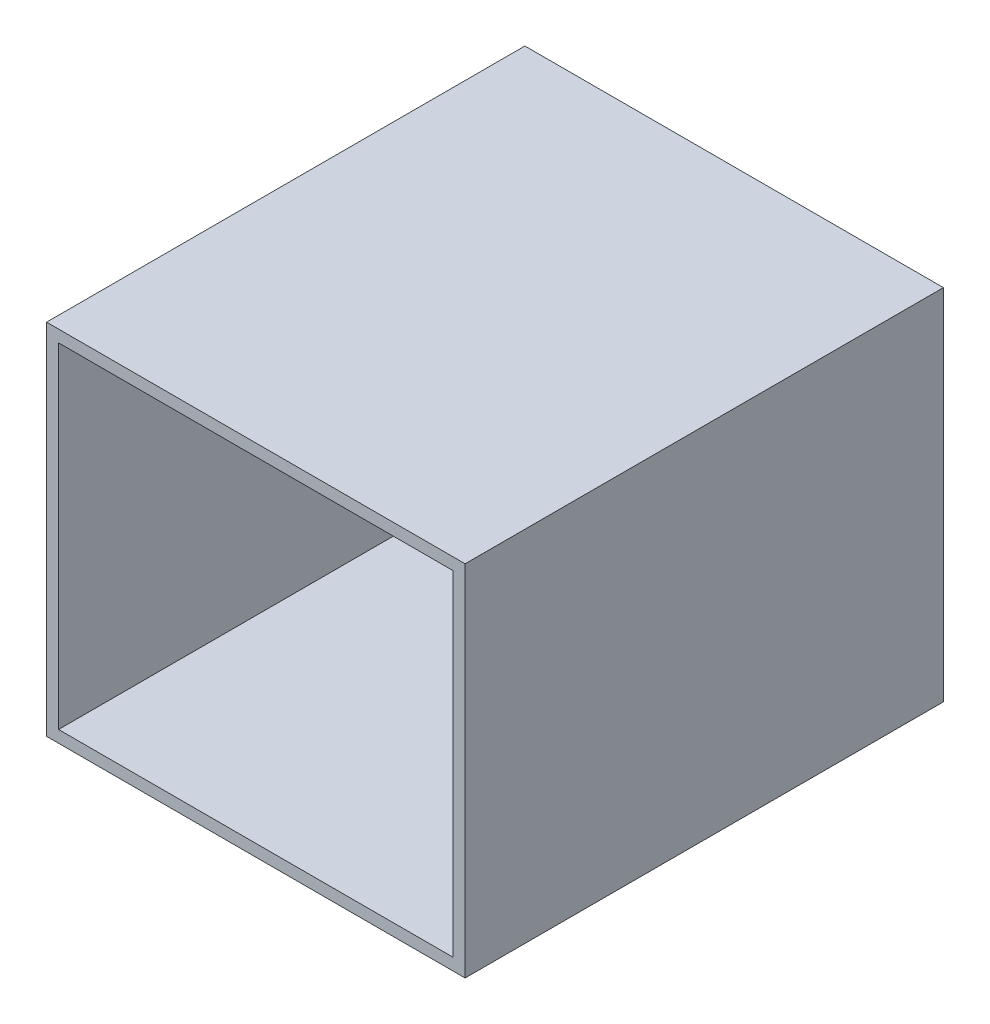
ISO-10303-21;
HEADER;
FILE_DESCRIPTION(('STEP AP214'),'2;1');
FILE_NAME('part.step','',(''),(''),'','','');
FILE_SCHEMA(('AUTOMOTIVE_DESIGN { 1 0 10303 214 1 1 1 1 }'));
ENDSEC;
DATA;
#1=APPLICATION_CONTEXT('core data for automotive mechanical design processes');
#2=APPLICATION_PROTOCOL_DEFINITION('international standard','automotive_design',2000,#1);
#3=PRODUCT_CONTEXT('',#1,'mechanical');
#4=PRODUCT('Part','Part','',(#3));
#5=PRODUCT_RELATED_PRODUCT_CATEGORY('part','',(#4));
#6=PRODUCT_DEFINITION_FORMATION('','',#4);
#7=PRODUCT_DEFINITION_CONTEXT('part definition',#1,'design');
#8=PRODUCT_DEFINITION('design','',#6,#7);
#9=PRODUCT_DEFINITION_SHAPE('','',#8);
#10=(LENGTH_UNIT() NAMED_UNIT(*) SI_UNIT(.MILLI.,.METRE.));
#11=(NAMED_UNIT(*) PLANE_ANGLE_UNIT() SI_UNIT($,.RADIAN.));
#12=(NAMED_UNIT(*) SI_UNIT($,.STERADIAN.) SOLID_ANGLE_UNIT());
#13=UNCERTAINTY_MEASURE_WITH_UNIT(LENGTH_MEASURE(1.E-05),#10,'distance_accuracy_value','');
#14=(GEOMETRIC_REPRESENTATION_CONTEXT(3) GLOBAL_UNCERTAINTY_ASSIGNED_CONTEXT((#13)) GLOBAL_UNIT_ASSIGNED_CONTEXT((#10,
#11,#12)) REPRESENTATION_CONTEXT('',''));
#15=CARTESIAN_POINT('',(0.,0.,0.));
#16=DIRECTION('',(0.,0.,1.));
#17=DIRECTION('',(1.,0.,0.));
#18=AXIS2_PLACEMENT_3D('',#15,#16,#17);
#19=CARTESIAN_POINT('',(0.,0.,10.));
#20=DIRECTION('',(0.,0.,1.));
#21=DIRECTION('',(1.,0.,0.));
#22=AXIS2_PLACEMENT_3D('',#19,#20,#21);
#23=PLANE('',#22);
#24=CARTESIAN_POINT('',(0.,-2.86403489739753,10.));
#25=DIRECTION('',(0.,0.,1.));
#26=DIRECTION('',(1.,0.,0.));
#27=AXIS2_PLACEMENT_3D('',#24,#25,#26);
#28=CIRCLE('',#27,60.);
#29=CARTESIAN_POINT('',(60.,-2.86403489739753,10.));
#30=VERTEX_POINT('',#29);
#31=EDGE_CURVE('E132',#30,#30,#28,.T.);
#32=ORIENTED_EDGE('',*,*,#31,.F.);
#33=EDGE_LOOP('',(#32));
#34=FACE_BOUND('',#33,.T.);
#35=DIRECTION('',(0.,1.,0.));
#36=VECTOR('',#35,1.);
#37=CARTESIAN_POINT('',(165.,0.,10.));
#38=LINE('',#37,#36);
#39=CARTESIAN_POINT('',(165.,-140.,10.));
#40=VERTEX_POINT('',#39);
#41=CARTESIAN_POINT('',(165.,140.,10.));
#42=VERTEX_POINT('',#41);
#43=EDGE_CURVE('E151',#40,#42,#38,.T.);
#44=ORIENTED_EDGE('',*,*,#43,.T.);
#45=DIRECTION('',(-1.,0.,0.));
#46=VECTOR('',#45,1.);
#47=CARTESIAN_POINT('',(0.,140.,10.));
#48=LINE('',#47,#46);
#49=CARTESIAN_POINT('',(-165.,140.,10.));
#50=VERTEX_POINT('',#49);
#51=EDGE_CURVE('E48',#42,#50,#48,.T.);
#52=ORIENTED_EDGE('',*,*,#51,.T.);
#53=DIRECTION('',(0.,-1.,0.));
#54=VECTOR('',#53,1.);
#55=CARTESIAN_POINT('',(-165.,0.,10.));
#56=LINE('',#55,#54);
#57=CARTESIAN_POINT('',(-165.,-140.,10.));
#58=VERTEX_POINT('',#57);
#59=EDGE_CURVE('E121',#50,#58,#56,.T.);
#60=ORIENTED_EDGE('',*,*,#59,.T.);
#61=DIRECTION('',(1.,0.,0.));
#62=VECTOR('',#61,1.);
#63=CARTESIAN_POINT('',(0.,-140.,10.));
#64=LINE('',#63,#62);
#65=EDGE_CURVE('E158',#58,#40,#64,.T.);
#66=ORIENTED_EDGE('',*,*,#65,.T.);
#67=EDGE_LOOP('',(#44,#52,#60,#66));
#68=FACE_BOUND('',#67,.T.);
#69=ADVANCED_FACE('F33',(#34,#68),#23,.T.);
#70=CARTESIAN_POINT('',(-165.,0.,0.));
#71=DIRECTION('',(-1.,0.,0.));
#72=DIRECTION('',(0.,0.,1.));
#73=AXIS2_PLACEMENT_3D('',#70,#71,#72);
#74=PLANE('',#73);
#75=DIRECTION('',(0.,0.,-1.));
#76=VECTOR('',#75,1.);
#77=CARTESIAN_POINT('',(-165.,140.,0.));
#78=LINE('',#77,#76);
#79=CARTESIAN_POINT('',(-165.,140.,400.));
#80=VERTEX_POINT('',#79);
#81=EDGE_CURVE('E163',#80,#50,#78,.T.);
#82=ORIENTED_EDGE('',*,*,#81,.F.);
#83=DIRECTION('',(0.,1.,0.));
#84=VECTOR('',#83,1.);
#85=CARTESIAN_POINT('',(-165.,150.,400.));
#86=LINE('',#85,#84);
#87=CARTESIAN_POINT('',(-165.,-140.,400.));
#88=VERTEX_POINT('',#87);
#89=EDGE_CURVE('E147',#88,#80,#86,.T.);
#90=ORIENTED_EDGE('',*,*,#89,.F.);
#91=DIRECTION('',(0.,0.,1.));
#92=VECTOR('',#91,1.);
#93=CARTESIAN_POINT('',(-165.,-140.,0.));
#94=LINE('',#93,#92);
#95=EDGE_CURVE('E112',#58,#88,#94,.T.);
#96=ORIENTED_EDGE('',*,*,#95,.F.);
#97=ORIENTED_EDGE('',*,*,#59,.F.);
#98=EDGE_LOOP('',(#82,#90,#96,#97));
#99=FACE_BOUND('',#98,.T.);
#100=ADVANCED_FACE('F177',(#99),#74,.F.);
#101=CARTESIAN_POINT('',(165.,0.,0.));
#102=DIRECTION('',(1.,0.,0.));
#103=DIRECTION('',(0.,0.,1.));
#104=AXIS2_PLACEMENT_3D('',#101,#102,#103);
#105=PLANE('',#104);
#106=DIRECTION('',(0.,0.,1.));
#107=VECTOR('',#106,1.);
#108=CARTESIAN_POINT('',(165.,140.,0.));
#109=LINE('',#108,#107);
#110=CARTESIAN_POINT('',(165.,140.,400.));
#111=VERTEX_POINT('',#110);
#112=EDGE_CURVE('E56',#42,#111,#109,.T.);
#113=ORIENTED_EDGE('',*,*,#112,.F.);
#114=ORIENTED_EDGE('',*,*,#43,.F.);
#115=DIRECTION('',(0.,0.,-1.));
#116=VECTOR('',#115,1.);
#117=CARTESIAN_POINT('',(165.,-140.,0.));
#118=LINE('',#117,#116);
#119=CARTESIAN_POINT('',(165.,-140.,400.));
#120=VERTEX_POINT('',#119);
#121=EDGE_CURVE('E11',#120,#40,#118,.T.);
#122=ORIENTED_EDGE('',*,*,#121,.F.);
#123=DIRECTION('',(0.,1.,0.));
#124=VECTOR('',#123,1.);
#125=CARTESIAN_POINT('',(165.,150.,400.));
#126=LINE('',#125,#124);
#127=EDGE_CURVE('E111',#120,#111,#126,.T.);
#128=ORIENTED_EDGE('',*,*,#127,.T.);
#129=EDGE_LOOP('',(#113,#114,#122,#128));
#130=FACE_BOUND('',#129,.T.);
#131=ADVANCED_FACE('F181',(#130),#105,.F.);
#132=CARTESIAN_POINT('',(175.,0.,10.));
#133=DIRECTION('',(1.,0.,0.));
#134=DIRECTION('',(0.,0.,-1.));
#135=AXIS2_PLACEMENT_3D('',#132,#133,#134);
#136=PLANE('',#135);
#137=DIRECTION('',(0.,0.,-1.));
#138=VECTOR('',#137,1.);
#139=CARTESIAN_POINT('',(175.,150.,10.));
#140=LINE('',#139,#138);
#141=CARTESIAN_POINT('',(175.,150.,400.));
#142=VERTEX_POINT('',#141);
#143=CARTESIAN_POINT('',(175.,150.,0.));
#144=VERTEX_POINT('',#143);
#145=EDGE_CURVE('E41',#142,#144,#140,.T.);
#146=ORIENTED_EDGE('',*,*,#145,.F.);
#147=DIRECTION('',(0.,1.,0.));
#148=VECTOR('',#147,1.);
#149=CARTESIAN_POINT('',(175.,150.,400.));
#150=LINE('',#149,#148);
#151=CARTESIAN_POINT('',(175.,-150.,400.));
#152=VERTEX_POINT('',#151);
#153=EDGE_CURVE('E99',#152,#142,#150,.T.);
#154=ORIENTED_EDGE('',*,*,#153,.F.);
#155=DIRECTION('',(0.,0.,-1.));
#156=VECTOR('',#155,1.);
#157=CARTESIAN_POINT('',(175.,-150.,10.));
#158=LINE('',#157,#156);
#159=CARTESIAN_POINT('',(175.,-150.,0.));
#160=VERTEX_POINT('',#159);
#161=EDGE_CURVE('E130',#152,#160,#158,.T.);
#162=ORIENTED_EDGE('',*,*,#161,.T.);
#163=DIRECTION('',(0.,-1.,0.));
#164=VECTOR('',#163,1.);
#165=CARTESIAN_POINT('',(175.,0.,0.));
#166=LINE('',#165,#164);
#167=EDGE_CURVE('E124',#144,#160,#166,.T.);
#168=ORIENTED_EDGE('',*,*,#167,.F.);
#169=EDGE_LOOP('',(#146,#154,#162,#168));
#170=FACE_BOUND('',#169,.T.);
#171=ADVANCED_FACE('F123',(#170),#136,.T.);
#172=CARTESIAN_POINT('',(0.,150.,10.));
#173=DIRECTION('',(0.,1.,0.));
#174=DIRECTION('',(0.,0.,1.));
#175=AXIS2_PLACEMENT_3D('',#172,#173,#174);
#176=PLANE('',#175);
#177=ORIENTED_EDGE('',*,*,#145,.T.);
#178=DIRECTION('',(1.,0.,0.));
#179=VECTOR('',#178,1.);
#180=CARTESIAN_POINT('',(0.,150.,0.));
#181=LINE('',#180,#179);
#182=CARTESIAN_POINT('',(-175.,150.,0.));
#183=VERTEX_POINT('',#182);
#184=EDGE_CURVE('E138',#183,#144,#181,.T.);
#185=ORIENTED_EDGE('',*,*,#184,.F.);
#186=DIRECTION('',(0.,0.,-1.));
#187=VECTOR('',#186,1.);
#188=CARTESIAN_POINT('',(-175.,150.,10.));
#189=LINE('',#188,#187);
#190=CARTESIAN_POINT('',(-175.,150.,400.));
#191=VERTEX_POINT('',#190);
#192=EDGE_CURVE('E120',#191,#183,#189,.T.);
#193=ORIENTED_EDGE('',*,*,#192,.F.);
#194=DIRECTION('',(-1.,0.,0.));
#195=VECTOR('',#194,1.);
#196=CARTESIAN_POINT('',(-165.,150.,400.));
#197=LINE('',#196,#195);
#198=EDGE_CURVE('E104',#142,#191,#197,.T.);
#199=ORIENTED_EDGE('',*,*,#198,.F.);
#200=EDGE_LOOP('',(#177,#185,#193,#199));
#201=FACE_BOUND('',#200,.T.);
#202=ADVANCED_FACE('F117',(#201),#176,.T.);
#203=CARTESIAN_POINT('',(-175.,0.,10.));
#204=DIRECTION('',(1.,0.,0.));
#205=DIRECTION('',(0.,0.,-1.));
#206=AXIS2_PLACEMENT_3D('',#203,#204,#205);
#207=PLANE('',#206);
#208=DIRECTION('',(0.,-1.,0.));
#209=VECTOR('',#208,1.);
#210=CARTESIAN_POINT('',(-175.,0.,0.));
#211=LINE('',#210,#209);
#212=CARTESIAN_POINT('',(-175.,-150.,0.));
#213=VERTEX_POINT('',#212);
#214=EDGE_CURVE('E136',#183,#213,#211,.T.);
#215=ORIENTED_EDGE('',*,*,#214,.T.);
#216=DIRECTION('',(0.,0.,-1.));
#217=VECTOR('',#216,1.);
#218=CARTESIAN_POINT('',(-175.,-150.,10.));
#219=LINE('',#218,#217);
#220=CARTESIAN_POINT('',(-175.,-150.,400.));
#221=VERTEX_POINT('',#220);
#222=EDGE_CURVE('E125',#221,#213,#219,.T.);
#223=ORIENTED_EDGE('',*,*,#222,.F.);
#224=DIRECTION('',(0.,1.,0.));
#225=VECTOR('',#224,1.);
#226=CARTESIAN_POINT('',(-175.,150.,400.));
#227=LINE('',#226,#225);
#228=EDGE_CURVE('E149',#221,#191,#227,.T.);
#229=ORIENTED_EDGE('',*,*,#228,.T.);
#230=ORIENTED_EDGE('',*,*,#192,.T.);
#231=EDGE_LOOP('',(#215,#223,#229,#230));
#232=FACE_BOUND('',#231,.T.);
#233=ADVANCED_FACE('F206',(#232),#207,.F.);
#234=CARTESIAN_POINT('',(0.,-2.86403489739753,10.));
#235=DIRECTION('',(0.,0.,-1.));
#236=DIRECTION('',(-1.,0.,0.));
#237=AXIS2_PLACEMENT_3D('',#234,#235,#236);
#238=CYLINDRICAL_SURFACE('',#237,60.);
#239=ORIENTED_EDGE('',*,*,#31,.T.);
#240=EDGE_LOOP('',(#239));
#241=FACE_BOUND('',#240,.T.);
#242=CARTESIAN_POINT('',(0.,-2.86403489739753,0.));
#243=DIRECTION('',(0.,0.,1.));
#244=DIRECTION('',(1.,0.,0.));
#245=AXIS2_PLACEMENT_3D('',#242,#243,#244);
#246=CIRCLE('',#245,60.);
#247=CARTESIAN_POINT('',(60.,-2.86403489739753,0.));
#248=VERTEX_POINT('',#247);
#249=EDGE_CURVE('E141',#248,#248,#246,.T.);
#250=ORIENTED_EDGE('',*,*,#249,.F.);
#251=EDGE_LOOP('',(#250));
#252=FACE_BOUND('',#251,.T.);
#253=ADVANCED_FACE('F35',(#241,#252),#238,.F.);
#254=CARTESIAN_POINT('',(0.,-150.,10.));
#255=DIRECTION('',(0.,1.,0.));
#256=DIRECTION('',(0.,0.,1.));
#257=AXIS2_PLACEMENT_3D('',#254,#255,#256);
#258=PLANE('',#257);
#259=ORIENTED_EDGE('',*,*,#161,.F.);
#260=DIRECTION('',(-1.,0.,0.));
#261=VECTOR('',#260,1.);
#262=CARTESIAN_POINT('',(-165.,-150.,400.));
#263=LINE('',#262,#261);
#264=EDGE_CURVE('E106',#152,#221,#263,.T.);
#265=ORIENTED_EDGE('',*,*,#264,.T.);
#266=ORIENTED_EDGE('',*,*,#222,.T.);
#267=DIRECTION('',(1.,0.,0.));
#268=VECTOR('',#267,1.);
#269=CARTESIAN_POINT('',(0.,-150.,0.));
#270=LINE('',#269,#268);
#271=EDGE_CURVE('E133',#213,#160,#270,.T.);
#272=ORIENTED_EDGE('',*,*,#271,.T.);
#273=EDGE_LOOP('',(#259,#265,#266,#272));
#274=FACE_BOUND('',#273,.T.);
#275=ADVANCED_FACE('F201',(#274),#258,.F.);
#276=CARTESIAN_POINT('',(0.,0.,0.));
#277=DIRECTION('',(0.,0.,1.));
#278=DIRECTION('',(1.,0.,0.));
#279=AXIS2_PLACEMENT_3D('',#276,#277,#278);
#280=PLANE('',#279);
#281=ORIENTED_EDGE('',*,*,#167,.T.);
#282=ORIENTED_EDGE('',*,*,#271,.F.);
#283=ORIENTED_EDGE('',*,*,#214,.F.);
#284=ORIENTED_EDGE('',*,*,#184,.T.);
#285=EDGE_LOOP('',(#281,#282,#283,#284));
#286=FACE_BOUND('',#285,.T.);
#287=ORIENTED_EDGE('',*,*,#249,.T.);
#288=EDGE_LOOP('',(#287));
#289=FACE_BOUND('',#288,.T.);
#290=ADVANCED_FACE('F198',(#286,#289),#280,.F.);
#291=CARTESIAN_POINT('',(-165.,150.,400.));
#292=DIRECTION('',(0.,0.,1.));
#293=DIRECTION('',(0.,-1.,0.));
#294=AXIS2_PLACEMENT_3D('',#291,#292,#293);
#295=PLANE('',#294);
#296=ORIENTED_EDGE('',*,*,#153,.T.);
#297=ORIENTED_EDGE('',*,*,#198,.T.);
#298=ORIENTED_EDGE('',*,*,#228,.F.);
#299=ORIENTED_EDGE('',*,*,#264,.F.);
#300=EDGE_LOOP('',(#296,#297,#298,#299));
#301=FACE_BOUND('',#300,.T.);
#302=ORIENTED_EDGE('',*,*,#89,.T.);
#303=DIRECTION('',(-1.,0.,0.));
#304=VECTOR('',#303,1.);
#305=CARTESIAN_POINT('',(-175.,140.,400.));
#306=LINE('',#305,#304);
#307=EDGE_CURVE('E168',#111,#80,#306,.T.);
#308=ORIENTED_EDGE('',*,*,#307,.F.);
#309=ORIENTED_EDGE('',*,*,#127,.F.);
#310=DIRECTION('',(-1.,0.,0.));
#311=VECTOR('',#310,1.);
#312=CARTESIAN_POINT('',(-175.,-140.,400.));
#313=LINE('',#312,#311);
#314=EDGE_CURVE('E160',#120,#88,#313,.T.);
#315=ORIENTED_EDGE('',*,*,#314,.T.);
#316=EDGE_LOOP('',(#302,#308,#309,#315));
#317=FACE_BOUND('',#316,.T.);
#318=ADVANCED_FACE('F101',(#301,#317),#295,.T.);
#319=CARTESIAN_POINT('',(0.,-140.,0.));
#320=DIRECTION('',(0.,-1.,0.));
#321=DIRECTION('',(0.,0.,-1.));
#322=AXIS2_PLACEMENT_3D('',#319,#320,#321);
#323=PLANE('',#322);
#324=ORIENTED_EDGE('',*,*,#65,.F.);
#325=ORIENTED_EDGE('',*,*,#95,.T.);
#326=ORIENTED_EDGE('',*,*,#314,.F.);
#327=ORIENTED_EDGE('',*,*,#121,.T.);
#328=EDGE_LOOP('',(#324,#325,#326,#327));
#329=FACE_BOUND('',#328,.T.);
#330=ADVANCED_FACE('F180',(#329),#323,.F.);
#331=CARTESIAN_POINT('',(0.,140.,0.));
#332=DIRECTION('',(0.,1.,0.));
#333=DIRECTION('',(0.,0.,-1.));
#334=AXIS2_PLACEMENT_3D('',#331,#332,#333);
#335=PLANE('',#334);
#336=ORIENTED_EDGE('',*,*,#307,.T.);
#337=ORIENTED_EDGE('',*,*,#81,.T.);
#338=ORIENTED_EDGE('',*,*,#51,.F.);
#339=ORIENTED_EDGE('',*,*,#112,.T.);
#340=EDGE_LOOP('',(#336,#337,#338,#339));
#341=FACE_BOUND('',#340,.T.);
#342=ADVANCED_FACE('F172',(#341),#335,.F.);
#343=CLOSED_SHELL('',(#69,#100,#131,#171,#202,#233,#253,#275,#290,#318,#330,#342));
#344=MANIFOLD_SOLID_BREP('B2',#343);
#345=ADVANCED_BREP_SHAPE_REPRESENTATION('',(#18,#344),#14);
#346=SHAPE_DEFINITION_REPRESENTATION(#9,#345);
ENDSEC;
END-ISO-10303-21;
